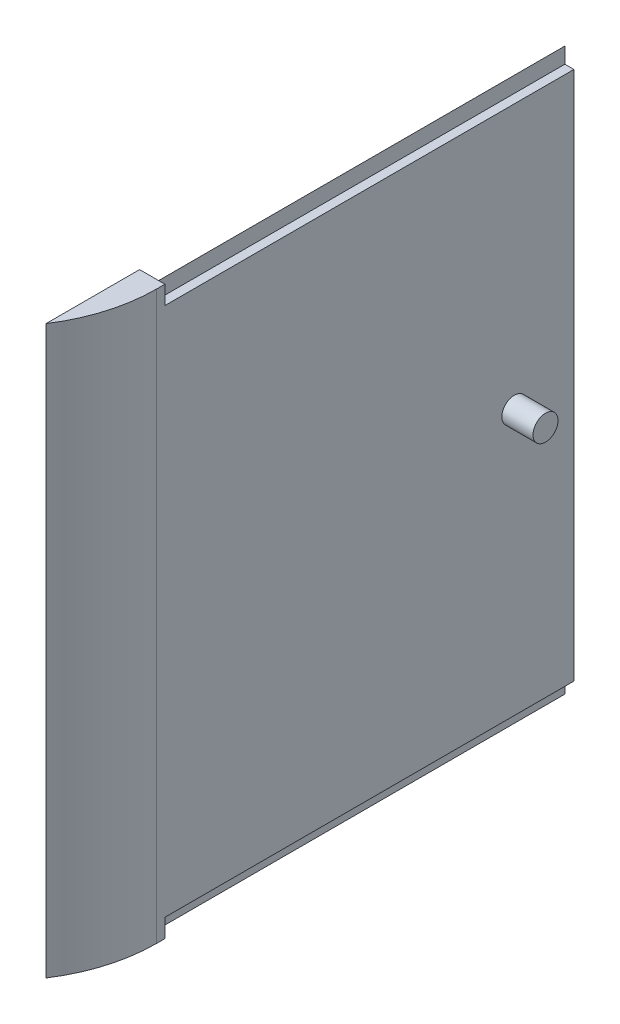
ISO-10303-21;
HEADER;
FILE_DESCRIPTION(('STEP AP214'),'2;1');
FILE_NAME('part.step','',(''),(''),'','','');
FILE_SCHEMA(('AUTOMOTIVE_DESIGN { 1 0 10303 214 1 1 1 1 }'));
ENDSEC;
DATA;
#1=APPLICATION_CONTEXT('core data for automotive mechanical design processes');
#2=APPLICATION_PROTOCOL_DEFINITION('international standard','automotive_design',2000,#1);
#3=PRODUCT_CONTEXT('',#1,'mechanical');
#4=PRODUCT('Part','Part','',(#3));
#5=PRODUCT_RELATED_PRODUCT_CATEGORY('part','',(#4));
#6=PRODUCT_DEFINITION_FORMATION('','',#4);
#7=PRODUCT_DEFINITION_CONTEXT('part definition',#1,'design');
#8=PRODUCT_DEFINITION('design','',#6,#7);
#9=PRODUCT_DEFINITION_SHAPE('','',#8);
#10=(LENGTH_UNIT() NAMED_UNIT(*) SI_UNIT(.MILLI.,.METRE.));
#11=(NAMED_UNIT(*) PLANE_ANGLE_UNIT() SI_UNIT($,.RADIAN.));
#12=(NAMED_UNIT(*) SI_UNIT($,.STERADIAN.) SOLID_ANGLE_UNIT());
#13=UNCERTAINTY_MEASURE_WITH_UNIT(LENGTH_MEASURE(1.E-05),#10,'distance_accuracy_value','');
#14=(GEOMETRIC_REPRESENTATION_CONTEXT(3) GLOBAL_UNCERTAINTY_ASSIGNED_CONTEXT((#13)) GLOBAL_UNIT_ASSIGNED_CONTEXT((#10,
#11,#12)) REPRESENTATION_CONTEXT('',''));
#15=CARTESIAN_POINT('',(0.,0.,0.));
#16=DIRECTION('',(0.,0.,1.));
#17=DIRECTION('',(1.,0.,0.));
#18=AXIS2_PLACEMENT_3D('',#15,#16,#17);
#19=CARTESIAN_POINT('',(37.6840725431511,-152.05,-105.));
#20=DIRECTION('',(1.,0.,0.));
#21=DIRECTION('',(0.,0.,-1.));
#22=AXIS2_PLACEMENT_3D('',#19,#20,#21);
#23=PLANE('',#22);
#24=DIRECTION('',(0.,1.,0.));
#25=VECTOR('',#24,1.);
#26=CARTESIAN_POINT('',(37.6840725431511,-152.05,0.));
#27=LINE('',#26,#25);
#28=CARTESIAN_POINT('',(37.6840725431511,-152.05,0.));
#29=VERTEX_POINT('',#28);
#30=CARTESIAN_POINT('',(37.6840725431511,-148.,0.));
#31=VERTEX_POINT('',#30);
#32=EDGE_CURVE('E160',#29,#31,#27,.T.);
#33=ORIENTED_EDGE('',*,*,#32,.F.);
#34=DIRECTION('',(0.,0.,1.));
#35=VECTOR('',#34,1.);
#36=CARTESIAN_POINT('',(37.6840725431511,-152.05,-105.));
#37=LINE('',#36,#35);
#38=CARTESIAN_POINT('',(37.6840725431511,-152.05,-105.));
#39=VERTEX_POINT('',#38);
#40=EDGE_CURVE('E126',#39,#29,#37,.T.);
#41=ORIENTED_EDGE('',*,*,#40,.F.);
#42=DIRECTION('',(0.,1.,0.));
#43=VECTOR('',#42,1.);
#44=CARTESIAN_POINT('',(37.6840725431511,-152.05,-105.));
#45=LINE('',#44,#43);
#46=CARTESIAN_POINT('',(37.6840725431511,-148.,-105.));
#47=VERTEX_POINT('',#46);
#48=EDGE_CURVE('E161',#39,#47,#45,.T.);
#49=ORIENTED_EDGE('',*,*,#48,.T.);
#50=DIRECTION('',(0.,0.,1.));
#51=VECTOR('',#50,1.);
#52=CARTESIAN_POINT('',(37.6840725431511,-148.,-105.));
#53=LINE('',#52,#51);
#54=EDGE_CURVE('E186',#47,#31,#53,.T.);
#55=ORIENTED_EDGE('',*,*,#54,.T.);
#56=EDGE_LOOP('',(#33,#41,#49,#55));
#57=FACE_BOUND('',#56,.T.);
#58=ADVANCED_FACE('F37',(#57),#23,.T.);
#59=CARTESIAN_POINT('',(33.6840725431511,-148.,-105.));
#60=DIRECTION('',(-0.711485024799432,-0.702701259061169,0.));
#61=DIRECTION('',(0.702701259061169,-0.711485024799432,0.));
#62=AXIS2_PLACEMENT_3D('',#59,#60,#61);
#63=PLANE('',#62);
#64=DIRECTION('',(0.702701259061168,-0.711485024799432,0.));
#65=VECTOR('',#64,1.);
#66=CARTESIAN_POINT('',(33.6840725431511,-148.,0.));
#67=LINE('',#66,#65);
#68=CARTESIAN_POINT('',(33.6840725431511,-148.,0.));
#69=VERTEX_POINT('',#68);
#70=EDGE_CURVE('E165',#69,#29,#67,.T.);
#71=ORIENTED_EDGE('',*,*,#70,.F.);
#72=DIRECTION('',(0.,0.,1.));
#73=VECTOR('',#72,1.);
#74=CARTESIAN_POINT('',(33.6840725431511,-148.,-105.));
#75=LINE('',#74,#73);
#76=CARTESIAN_POINT('',(33.6840725431511,-148.,-105.));
#77=VERTEX_POINT('',#76);
#78=EDGE_CURVE('E208',#77,#69,#75,.T.);
#79=ORIENTED_EDGE('',*,*,#78,.F.);
#80=DIRECTION('',(0.702701259061168,-0.711485024799432,0.));
#81=VECTOR('',#80,1.);
#82=CARTESIAN_POINT('',(33.6840725431511,-148.,-105.));
#83=LINE('',#82,#81);
#84=EDGE_CURVE('E183',#77,#39,#83,.T.);
#85=ORIENTED_EDGE('',*,*,#84,.T.);
#86=ORIENTED_EDGE('',*,*,#40,.T.);
#87=EDGE_LOOP('',(#71,#79,#85,#86));
#88=FACE_BOUND('',#87,.T.);
#89=ADVANCED_FACE('F232',(#88),#63,.T.);
#90=CARTESIAN_POINT('',(33.6840725431511,-12.,-105.));
#91=DIRECTION('',(-1.,0.,0.));
#92=DIRECTION('',(0.,0.,1.));
#93=AXIS2_PLACEMENT_3D('',#90,#91,#92);
#94=PLANE('',#93);
#95=DIRECTION('',(0.,-1.,0.));
#96=VECTOR('',#95,1.);
#97=CARTESIAN_POINT('',(33.6840725431511,-12.,0.));
#98=LINE('',#97,#96);
#99=CARTESIAN_POINT('',(33.6840725431511,-12.,0.));
#100=VERTEX_POINT('',#99);
#101=EDGE_CURVE('E201',#100,#69,#98,.T.);
#102=ORIENTED_EDGE('',*,*,#101,.F.);
#103=DIRECTION('',(0.,0.,1.));
#104=VECTOR('',#103,1.);
#105=CARTESIAN_POINT('',(33.6840725431511,-12.,-105.));
#106=LINE('',#105,#104);
#107=CARTESIAN_POINT('',(33.6840725431511,-12.,-105.));
#108=VERTEX_POINT('',#107);
#109=EDGE_CURVE('E210',#108,#100,#106,.T.);
#110=ORIENTED_EDGE('',*,*,#109,.F.);
#111=DIRECTION('',(0.,-1.,0.));
#112=VECTOR('',#111,1.);
#113=CARTESIAN_POINT('',(33.6840725431511,-12.,-105.));
#114=LINE('',#113,#112);
#115=EDGE_CURVE('E180',#108,#77,#114,.T.);
#116=ORIENTED_EDGE('',*,*,#115,.T.);
#117=ORIENTED_EDGE('',*,*,#78,.T.);
#118=EDGE_LOOP('',(#102,#110,#116,#117));
#119=FACE_BOUND('',#118,.T.);
#120=ADVANCED_FACE('F258',(#119),#94,.T.);
#121=CARTESIAN_POINT('',(37.6840725431511,-7.95000000000001,-105.));
#122=DIRECTION('',(-0.711485024799432,0.702701259061169,0.));
#123=DIRECTION('',(-0.702701259061169,-0.711485024799432,0.));
#124=AXIS2_PLACEMENT_3D('',#121,#122,#123);
#125=PLANE('',#124);
#126=DIRECTION('',(-0.702701259061168,-0.711485024799432,0.));
#127=VECTOR('',#126,1.);
#128=CARTESIAN_POINT('',(37.6840725431511,-7.95000000000001,0.));
#129=LINE('',#128,#127);
#130=CARTESIAN_POINT('',(37.6840725431511,-7.95000000000001,0.));
#131=VERTEX_POINT('',#130);
#132=EDGE_CURVE('E198',#131,#100,#129,.T.);
#133=ORIENTED_EDGE('',*,*,#132,.F.);
#134=DIRECTION('',(0.,0.,1.));
#135=VECTOR('',#134,1.);
#136=CARTESIAN_POINT('',(37.6840725431511,-7.95000000000001,-105.));
#137=LINE('',#136,#135);
#138=CARTESIAN_POINT('',(37.6840725431511,-7.95000000000001,-105.));
#139=VERTEX_POINT('',#138);
#140=EDGE_CURVE('E212',#139,#131,#137,.T.);
#141=ORIENTED_EDGE('',*,*,#140,.F.);
#142=DIRECTION('',(-0.702701259061168,-0.711485024799432,0.));
#143=VECTOR('',#142,1.);
#144=CARTESIAN_POINT('',(37.6840725431511,-7.95000000000001,-105.));
#145=LINE('',#144,#143);
#146=EDGE_CURVE('E177',#139,#108,#145,.T.);
#147=ORIENTED_EDGE('',*,*,#146,.T.);
#148=ORIENTED_EDGE('',*,*,#109,.T.);
#149=EDGE_LOOP('',(#133,#141,#147,#148));
#150=FACE_BOUND('',#149,.T.);
#151=ADVANCED_FACE('F273',(#150),#125,.T.);
#152=CARTESIAN_POINT('',(37.6840725431511,-12.,-105.));
#153=DIRECTION('',(1.,0.,0.));
#154=DIRECTION('',(0.,0.,-1.));
#155=AXIS2_PLACEMENT_3D('',#152,#153,#154);
#156=PLANE('',#155);
#157=DIRECTION('',(0.,1.,0.));
#158=VECTOR('',#157,1.);
#159=CARTESIAN_POINT('',(37.6840725431511,-12.,0.));
#160=LINE('',#159,#158);
#161=CARTESIAN_POINT('',(37.6840725431511,-12.,0.));
#162=VERTEX_POINT('',#161);
#163=EDGE_CURVE('E195',#162,#131,#160,.T.);
#164=ORIENTED_EDGE('',*,*,#163,.F.);
#165=DIRECTION('',(0.,0.,1.));
#166=VECTOR('',#165,1.);
#167=CARTESIAN_POINT('',(37.6840725431511,-12.,-105.));
#168=LINE('',#167,#166);
#169=CARTESIAN_POINT('',(37.6840725431511,-12.,-105.));
#170=VERTEX_POINT('',#169);
#171=EDGE_CURVE('E214',#170,#162,#168,.T.);
#172=ORIENTED_EDGE('',*,*,#171,.F.);
#173=DIRECTION('',(0.,1.,0.));
#174=VECTOR('',#173,1.);
#175=CARTESIAN_POINT('',(37.6840725431511,-12.,-105.));
#176=LINE('',#175,#174);
#177=EDGE_CURVE('E174',#170,#139,#176,.T.);
#178=ORIENTED_EDGE('',*,*,#177,.T.);
#179=ORIENTED_EDGE('',*,*,#140,.T.);
#180=EDGE_LOOP('',(#164,#172,#178,#179));
#181=FACE_BOUND('',#180,.T.);
#182=ADVANCED_FACE('F269',(#181),#156,.T.);
#183=CARTESIAN_POINT('',(37.6840725431511,-12.,-105.));
#184=DIRECTION('',(0.,1.,0.));
#185=DIRECTION('',(-1.,0.,0.));
#186=AXIS2_PLACEMENT_3D('',#183,#184,#185);
#187=PLANE('',#186);
#188=DIRECTION('',(-1.,0.,0.));
#189=VECTOR('',#188,1.);
#190=CARTESIAN_POINT('',(37.6840725431511,-12.,0.));
#191=LINE('',#190,#189);
#192=CARTESIAN_POINT('',(40.,-12.,0.));
#193=VERTEX_POINT('',#192);
#194=EDGE_CURVE('E192',#193,#162,#191,.T.);
#195=ORIENTED_EDGE('',*,*,#194,.F.);
#196=DIRECTION('',(0.,0.,1.));
#197=VECTOR('',#196,1.);
#198=CARTESIAN_POINT('',(40.,-12.,-105.));
#199=LINE('',#198,#197);
#200=CARTESIAN_POINT('',(40.,-12.,-105.));
#201=VERTEX_POINT('',#200);
#202=EDGE_CURVE('E216',#201,#193,#199,.T.);
#203=ORIENTED_EDGE('',*,*,#202,.F.);
#204=DIRECTION('',(-1.,0.,0.));
#205=VECTOR('',#204,1.);
#206=CARTESIAN_POINT('',(37.6840725431511,-12.,-105.));
#207=LINE('',#206,#205);
#208=EDGE_CURVE('E171',#201,#170,#207,.T.);
#209=ORIENTED_EDGE('',*,*,#208,.T.);
#210=ORIENTED_EDGE('',*,*,#171,.T.);
#211=EDGE_LOOP('',(#195,#203,#209,#210));
#212=FACE_BOUND('',#211,.T.);
#213=ADVANCED_FACE('F265',(#212),#187,.T.);
#214=CARTESIAN_POINT('',(40.,-12.,-105.));
#215=DIRECTION('',(1.,0.,0.));
#216=DIRECTION('',(0.,0.,-1.));
#217=AXIS2_PLACEMENT_3D('',#214,#215,#216);
#218=PLANE('',#217);
#219=CARTESIAN_POINT('',(40.,-80.,-89.7147562589282));
#220=DIRECTION('',(1.,0.,0.));
#221=DIRECTION('',(0.,0.,-1.));
#222=AXIS2_PLACEMENT_3D('',#219,#220,#221);
#223=CIRCLE('',#222,3.21909799375135);
#224=CARTESIAN_POINT('',(40.,-80.,-92.9338542526796));
#225=VERTEX_POINT('',#224);
#226=EDGE_CURVE('E150',#225,#225,#223,.T.);
#227=ORIENTED_EDGE('',*,*,#226,.F.);
#228=EDGE_LOOP('',(#227));
#229=FACE_BOUND('',#228,.T.);
#230=DIRECTION('',(0.,0.,-1.));
#231=VECTOR('',#230,1.);
#232=CARTESIAN_POINT('',(40.,-7.25000000000001,24.));
#233=LINE('',#232,#231);
#234=CARTESIAN_POINT('',(40.,-7.25000000000001,2.14250700560558));
#235=VERTEX_POINT('',#234);
#236=CARTESIAN_POINT('',(40.,-7.25000000000001,0.));
#237=VERTEX_POINT('',#236);
#238=EDGE_CURVE('E135',#235,#237,#233,.T.);
#239=ORIENTED_EDGE('',*,*,#238,.F.);
#240=DIRECTION('',(0.,1.,0.));
#241=VECTOR('',#240,1.);
#242=CARTESIAN_POINT('',(40.,-152.75,2.14250700560558));
#243=LINE('',#242,#241);
#244=CARTESIAN_POINT('',(40.,-152.75,2.14250700560558));
#245=VERTEX_POINT('',#244);
#246=EDGE_CURVE('E45',#235,#245,#243,.F.);
#247=ORIENTED_EDGE('',*,*,#246,.T.);
#248=DIRECTION('',(0.,0.,-1.));
#249=VECTOR('',#248,1.);
#250=CARTESIAN_POINT('',(40.,-152.75,24.));
#251=LINE('',#250,#249);
#252=CARTESIAN_POINT('',(40.,-152.75,0.));
#253=VERTEX_POINT('',#252);
#254=EDGE_CURVE('E141',#245,#253,#251,.T.);
#255=ORIENTED_EDGE('',*,*,#254,.T.);
#256=DIRECTION('',(0.,1.,0.));
#257=VECTOR('',#256,1.);
#258=CARTESIAN_POINT('',(40.,-7.25000000000001,0.));
#259=LINE('',#258,#257);
#260=CARTESIAN_POINT('',(40.,-148.,0.));
#261=VERTEX_POINT('',#260);
#262=EDGE_CURVE('E152',#253,#261,#259,.T.);
#263=ORIENTED_EDGE('',*,*,#262,.T.);
#264=DIRECTION('',(0.,0.,1.));
#265=VECTOR('',#264,1.);
#266=CARTESIAN_POINT('',(40.,-148.,-105.));
#267=LINE('',#266,#265);
#268=CARTESIAN_POINT('',(40.,-148.,-105.));
#269=VERTEX_POINT('',#268);
#270=EDGE_CURVE('E218',#269,#261,#267,.T.);
#271=ORIENTED_EDGE('',*,*,#270,.F.);
#272=DIRECTION('',(0.,1.,0.));
#273=VECTOR('',#272,1.);
#274=CARTESIAN_POINT('',(40.,-12.,-105.));
#275=LINE('',#274,#273);
#276=EDGE_CURVE('E168',#269,#201,#275,.T.);
#277=ORIENTED_EDGE('',*,*,#276,.T.);
#278=ORIENTED_EDGE('',*,*,#202,.T.);
#279=EDGE_CURVE('E155',#193,#237,#259,.T.);
#280=ORIENTED_EDGE('',*,*,#279,.T.);
#281=EDGE_LOOP('',(#239,#247,#255,#263,#271,#277,#278,#280));
#282=FACE_BOUND('',#281,.T.);
#283=ADVANCED_FACE('F240',(#229,#282),#218,.T.);
#284=CARTESIAN_POINT('',(37.6840725431511,-148.,-105.));
#285=DIRECTION('',(0.,-1.,0.));
#286=DIRECTION('',(0.,0.,-1.));
#287=AXIS2_PLACEMENT_3D('',#284,#285,#286);
#288=PLANE('',#287);
#289=DIRECTION('',(1.,0.,0.));
#290=VECTOR('',#289,1.);
#291=CARTESIAN_POINT('',(37.6840725431511,-148.,0.));
#292=LINE('',#291,#290);
#293=EDGE_CURVE('E189',#31,#261,#292,.T.);
#294=ORIENTED_EDGE('',*,*,#293,.F.);
#295=ORIENTED_EDGE('',*,*,#54,.F.);
#296=DIRECTION('',(1.,0.,0.));
#297=VECTOR('',#296,1.);
#298=CARTESIAN_POINT('',(37.6840725431511,-148.,-105.));
#299=LINE('',#298,#297);
#300=EDGE_CURVE('E164',#47,#269,#299,.T.);
#301=ORIENTED_EDGE('',*,*,#300,.T.);
#302=ORIENTED_EDGE('',*,*,#270,.T.);
#303=EDGE_LOOP('',(#294,#295,#301,#302));
#304=FACE_BOUND('',#303,.T.);
#305=ADVANCED_FACE('F225',(#304),#288,.T.);
#306=CARTESIAN_POINT('',(0.,0.,-105.));
#307=DIRECTION('',(0.,0.,-1.));
#308=DIRECTION('',(-1.,0.,0.));
#309=AXIS2_PLACEMENT_3D('',#306,#307,#308);
#310=PLANE('',#309);
#311=ORIENTED_EDGE('',*,*,#48,.F.);
#312=ORIENTED_EDGE('',*,*,#84,.F.);
#313=ORIENTED_EDGE('',*,*,#115,.F.);
#314=ORIENTED_EDGE('',*,*,#146,.F.);
#315=ORIENTED_EDGE('',*,*,#177,.F.);
#316=ORIENTED_EDGE('',*,*,#208,.F.);
#317=ORIENTED_EDGE('',*,*,#276,.F.);
#318=ORIENTED_EDGE('',*,*,#300,.F.);
#319=EDGE_LOOP('',(#311,#312,#313,#314,#315,#316,#317,#318));
#320=FACE_BOUND('',#319,.T.);
#321=ADVANCED_FACE('F235',(#320),#310,.T.);
#322=CARTESIAN_POINT('',(40.,-7.25000000000001,24.));
#323=DIRECTION('',(0.,-1.,0.));
#324=DIRECTION('',(1.,0.,0.));
#325=AXIS2_PLACEMENT_3D('',#322,#323,#324);
#326=PLANE('',#325);
#327=DIRECTION('',(0.,0.,-1.));
#328=VECTOR('',#327,1.);
#329=CARTESIAN_POINT('',(33.5,-7.25000000000001,24.));
#330=LINE('',#329,#328);
#331=CARTESIAN_POINT('',(33.5,-7.25000000000001,24.));
#332=VERTEX_POINT('',#331);
#333=CARTESIAN_POINT('',(33.5,-7.25000000000001,0.));
#334=VERTEX_POINT('',#333);
#335=EDGE_CURVE('E129',#332,#334,#330,.T.);
#336=ORIENTED_EDGE('',*,*,#335,.F.);
#337=CARTESIAN_POINT('',(0.,-7.25000000000001,2.14250700560558));
#338=DIRECTION('',(0.,-1.,0.));
#339=DIRECTION('',(1.,0.,0.));
#340=AXIS2_PLACEMENT_3D('',#337,#338,#339);
#341=CIRCLE('',#340,40.);
#342=EDGE_CURVE('E59',#332,#235,#341,.F.);
#343=ORIENTED_EDGE('',*,*,#342,.T.);
#344=ORIENTED_EDGE('',*,*,#238,.T.);
#345=DIRECTION('',(-1.,0.,0.));
#346=VECTOR('',#345,1.);
#347=CARTESIAN_POINT('',(40.,-7.25000000000001,0.));
#348=LINE('',#347,#346);
#349=EDGE_CURVE('E132',#237,#334,#348,.T.);
#350=ORIENTED_EDGE('',*,*,#349,.T.);
#351=EDGE_LOOP('',(#336,#343,#344,#350));
#352=FACE_BOUND('',#351,.T.);
#353=ADVANCED_FACE('F130',(#352),#326,.F.);
#354=CARTESIAN_POINT('',(33.5,-152.75,24.));
#355=DIRECTION('',(1.,0.,0.));
#356=DIRECTION('',(0.,1.,0.));
#357=AXIS2_PLACEMENT_3D('',#354,#355,#356);
#358=PLANE('',#357);
#359=DIRECTION('',(0.,-1.,0.));
#360=VECTOR('',#359,1.);
#361=CARTESIAN_POINT('',(33.5,-152.75,0.));
#362=LINE('',#361,#360);
#363=CARTESIAN_POINT('',(33.5,-152.75,0.));
#364=VERTEX_POINT('',#363);
#365=EDGE_CURVE('E146',#334,#364,#362,.T.);
#366=ORIENTED_EDGE('',*,*,#365,.T.);
#367=DIRECTION('',(0.,0.,-1.));
#368=VECTOR('',#367,1.);
#369=CARTESIAN_POINT('',(33.5,-152.75,24.));
#370=LINE('',#369,#368);
#371=CARTESIAN_POINT('',(33.5,-152.75,24.));
#372=VERTEX_POINT('',#371);
#373=EDGE_CURVE('E136',#372,#364,#370,.T.);
#374=ORIENTED_EDGE('',*,*,#373,.F.);
#375=DIRECTION('',(0.,-1.,0.));
#376=VECTOR('',#375,1.);
#377=CARTESIAN_POINT('',(33.5,-152.75,24.));
#378=LINE('',#377,#376);
#379=EDGE_CURVE('E125',#332,#372,#378,.T.);
#380=ORIENTED_EDGE('',*,*,#379,.F.);
#381=ORIENTED_EDGE('',*,*,#335,.T.);
#382=EDGE_LOOP('',(#366,#374,#380,#381));
#383=FACE_BOUND('',#382,.T.);
#384=ADVANCED_FACE('F139',(#383),#358,.F.);
#385=CARTESIAN_POINT('',(40.,-152.75,24.));
#386=DIRECTION('',(0.,1.,0.));
#387=DIRECTION('',(0.,0.,1.));
#388=AXIS2_PLACEMENT_3D('',#385,#386,#387);
#389=PLANE('',#388);
#390=ORIENTED_EDGE('',*,*,#254,.F.);
#391=CARTESIAN_POINT('',(0.,-152.75,2.14250700560558));
#392=DIRECTION('',(0.,1.,0.));
#393=DIRECTION('',(0.,0.,1.));
#394=AXIS2_PLACEMENT_3D('',#391,#392,#393);
#395=CIRCLE('',#394,40.);
#396=EDGE_CURVE('E11',#245,#372,#395,.F.);
#397=ORIENTED_EDGE('',*,*,#396,.T.);
#398=ORIENTED_EDGE('',*,*,#373,.T.);
#399=DIRECTION('',(1.,0.,0.));
#400=VECTOR('',#399,1.);
#401=CARTESIAN_POINT('',(40.,-152.75,0.));
#402=LINE('',#401,#400);
#403=EDGE_CURVE('E142',#364,#253,#402,.T.);
#404=ORIENTED_EDGE('',*,*,#403,.T.);
#405=EDGE_LOOP('',(#390,#397,#398,#404));
#406=FACE_BOUND('',#405,.T.);
#407=ADVANCED_FACE('F245',(#406),#389,.F.);
#408=CARTESIAN_POINT('',(0.,0.,0.));
#409=DIRECTION('',(0.,0.,-1.));
#410=DIRECTION('',(-1.,0.,0.));
#411=AXIS2_PLACEMENT_3D('',#408,#409,#410);
#412=PLANE('',#411);
#413=ORIENTED_EDGE('',*,*,#32,.T.);
#414=ORIENTED_EDGE('',*,*,#293,.T.);
#415=ORIENTED_EDGE('',*,*,#262,.F.);
#416=ORIENTED_EDGE('',*,*,#403,.F.);
#417=ORIENTED_EDGE('',*,*,#365,.F.);
#418=ORIENTED_EDGE('',*,*,#349,.F.);
#419=ORIENTED_EDGE('',*,*,#279,.F.);
#420=ORIENTED_EDGE('',*,*,#194,.T.);
#421=ORIENTED_EDGE('',*,*,#163,.T.);
#422=ORIENTED_EDGE('',*,*,#132,.T.);
#423=ORIENTED_EDGE('',*,*,#101,.T.);
#424=ORIENTED_EDGE('',*,*,#70,.T.);
#425=EDGE_LOOP('',(#413,#414,#415,#416,#417,#418,#419,#420,#421,#422,#423,#424));
#426=FACE_BOUND('',#425,.T.);
#427=ADVANCED_FACE('F228',(#426),#412,.T.);
#428=CARTESIAN_POINT('',(0.,0.,2.14250700560558));
#429=DIRECTION('',(0.,-1.,0.));
#430=DIRECTION('',(1.,0.,0.));
#431=AXIS2_PLACEMENT_3D('',#428,#429,#430);
#432=CYLINDRICAL_SURFACE('',#431,40.);
#433=ORIENTED_EDGE('',*,*,#396,.F.);
#434=ORIENTED_EDGE('',*,*,#246,.F.);
#435=ORIENTED_EDGE('',*,*,#342,.F.);
#436=ORIENTED_EDGE('',*,*,#379,.T.);
#437=EDGE_LOOP('',(#433,#434,#435,#436));
#438=FACE_BOUND('',#437,.T.);
#439=ADVANCED_FACE('F39',(#438),#432,.T.);
#440=CARTESIAN_POINT('',(48.,-80.,-89.7147562589282));
#441=DIRECTION('',(-1.,0.,0.));
#442=DIRECTION('',(0.,0.,1.));
#443=AXIS2_PLACEMENT_3D('',#440,#441,#442);
#444=CYLINDRICAL_SURFACE('',#443,3.21909799375135);
#445=CARTESIAN_POINT('',(48.,-80.,-89.7147562589282));
#446=DIRECTION('',(1.,0.,0.));
#447=DIRECTION('',(0.,0.,-1.));
#448=AXIS2_PLACEMENT_3D('',#445,#446,#447);
#449=CIRCLE('',#448,3.21909799375135);
#450=CARTESIAN_POINT('',(48.,-80.,-92.9338542526796));
#451=VERTEX_POINT('',#450);
#452=EDGE_CURVE('E338',#451,#451,#449,.T.);
#453=ORIENTED_EDGE('',*,*,#452,.F.);
#454=EDGE_LOOP('',(#453));
#455=FACE_BOUND('',#454,.T.);
#456=ORIENTED_EDGE('',*,*,#226,.T.);
#457=EDGE_LOOP('',(#456));
#458=FACE_BOUND('',#457,.T.);
#459=ADVANCED_FACE('F307',(#455,#458),#444,.T.);
#460=CARTESIAN_POINT('',(48.,-80.,-89.7147562589282));
#461=DIRECTION('',(1.,0.,0.));
#462=DIRECTION('',(0.,0.,-1.));
#463=AXIS2_PLACEMENT_3D('',#460,#461,#462);
#464=PLANE('',#463);
#465=ORIENTED_EDGE('',*,*,#452,.T.);
#466=EDGE_LOOP('',(#465));
#467=FACE_BOUND('',#466,.T.);
#468=ADVANCED_FACE('F322',(#467),#464,.T.);
#469=CLOSED_SHELL('',(#58,#89,#120,#151,#182,#213,#283,#305,#321,#353,#384,#407,#427,#439,#459,#468));
#470=MANIFOLD_SOLID_BREP('B2',#469);
#471=ADVANCED_BREP_SHAPE_REPRESENTATION('',(#18,#470),#14);
#472=SHAPE_DEFINITION_REPRESENTATION(#9,#471);
ENDSEC;
END-ISO-10303-21;
